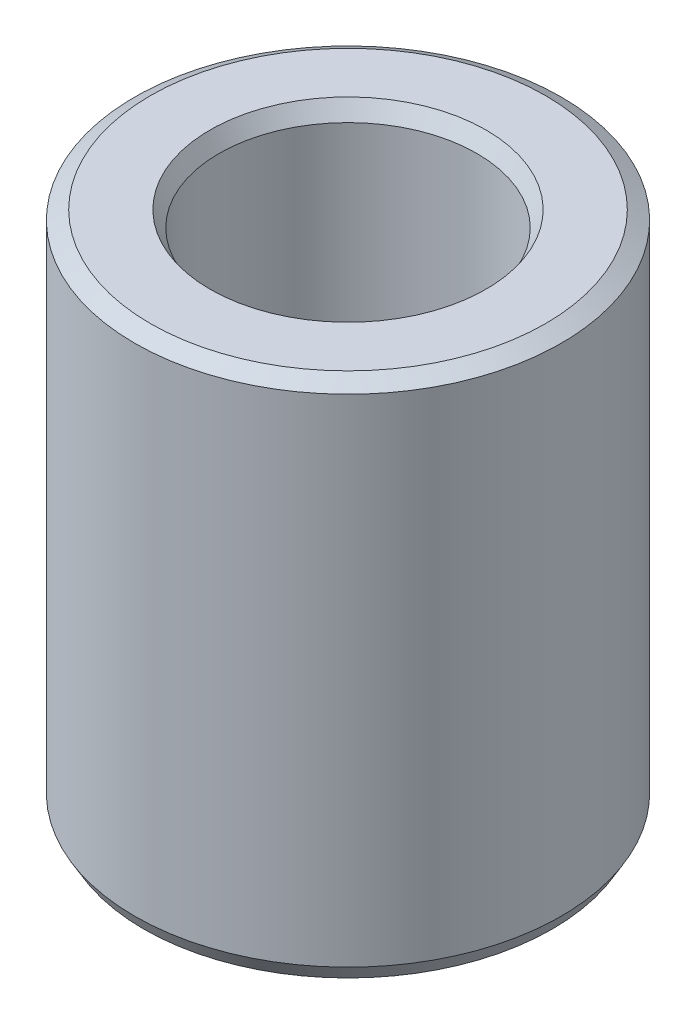
ISO-10303-21;
HEADER;
FILE_DESCRIPTION(('STEP AP214'),'2;1');
FILE_NAME('part.step','',(''),(''),'','','');
FILE_SCHEMA(('AUTOMOTIVE_DESIGN { 1 0 10303 214 1 1 1 1 }'));
ENDSEC;
DATA;
#1=APPLICATION_CONTEXT('core data for automotive mechanical design processes');
#2=APPLICATION_PROTOCOL_DEFINITION('international standard','automotive_design',2000,#1);
#3=PRODUCT_CONTEXT('',#1,'mechanical');
#4=PRODUCT('Part','Part','',(#3));
#5=PRODUCT_RELATED_PRODUCT_CATEGORY('part','',(#4));
#6=PRODUCT_DEFINITION_FORMATION('','',#4);
#7=PRODUCT_DEFINITION_CONTEXT('part definition',#1,'design');
#8=PRODUCT_DEFINITION('design','',#6,#7);
#9=PRODUCT_DEFINITION_SHAPE('','',#8);
#10=(LENGTH_UNIT() NAMED_UNIT(*) SI_UNIT(.MILLI.,.METRE.));
#11=(NAMED_UNIT(*) PLANE_ANGLE_UNIT() SI_UNIT($,.RADIAN.));
#12=(NAMED_UNIT(*) SI_UNIT($,.STERADIAN.) SOLID_ANGLE_UNIT());
#13=UNCERTAINTY_MEASURE_WITH_UNIT(LENGTH_MEASURE(1.E-05),#10,'distance_accuracy_value','');
#14=(GEOMETRIC_REPRESENTATION_CONTEXT(3) GLOBAL_UNCERTAINTY_ASSIGNED_CONTEXT((#13)) GLOBAL_UNIT_ASSIGNED_CONTEXT((#10,
#11,#12)) REPRESENTATION_CONTEXT('',''));
#15=CARTESIAN_POINT('',(0.,0.,0.));
#16=DIRECTION('',(0.,0.,1.));
#17=DIRECTION('',(1.,0.,0.));
#18=AXIS2_PLACEMENT_3D('',#15,#16,#17);
#19=CARTESIAN_POINT('',(0.,116.042489561249,0.));
#20=DIRECTION('',(0.,-1.,0.));
#21=DIRECTION('',(0.,0.,-1.));
#22=AXIS2_PLACEMENT_3D('',#19,#20,#21);
#23=CYLINDRICAL_SURFACE('',#22,47.5);
#24=CARTESIAN_POINT('',(0.,3.51237934349137,0.));
#25=DIRECTION('',(0.,1.,0.));
#26=DIRECTION('',(0.,0.,1.));
#27=AXIS2_PLACEMENT_3D('',#24,#25,#26);
#28=CIRCLE('',#27,47.5);
#29=CARTESIAN_POINT('',(0.,3.51237934349137,-47.5));
#30=VERTEX_POINT('',#29);
#31=EDGE_CURVE('E10',#30,#30,#28,.T.);
#32=CARTESIAN_POINT('',(0.,114.014616401789,0.));
#33=DIRECTION('',(0.,1.,0.));
#34=DIRECTION('',(0.,0.,1.));
#35=AXIS2_PLACEMENT_3D('',#32,#33,#34);
#36=CIRCLE('',#35,47.5);
#37=CARTESIAN_POINT('',(0.,114.014616401789,-47.5));
#38=VERTEX_POINT('',#37);
#39=EDGE_CURVE('E50',#38,#38,#36,.F.);
#40=CARTESIAN_POINT('',(0.,3.51237934349137,-47.5));
#41=CARTESIAN_POINT('',(0.,4.66344431284864,-47.5));
#42=CARTESIAN_POINT('',(0.,5.8145092822059,-47.5));
#43=CARTESIAN_POINT('',(0.,8.11663922092043,-47.5));
#44=CARTESIAN_POINT('',(0.,9.2677041902777,-47.5));
#45=CARTESIAN_POINT('',(0.,11.5698341289922,-47.5));
#46=CARTESIAN_POINT('',(0.,12.7208990983495,-47.5));
#47=CARTESIAN_POINT('',(0.,15.023029037064,-47.5));
#48=CARTESIAN_POINT('',(0.,16.1740940064213,-47.5));
#49=CARTESIAN_POINT('',(0.,18.4762239451358,-47.5));
#50=CARTESIAN_POINT('',(0.,19.6272889144931,-47.5));
#51=CARTESIAN_POINT('',(0.,21.9294188532076,-47.5));
#52=CARTESIAN_POINT('',(0.,23.0804838225649,-47.5));
#53=CARTESIAN_POINT('',(0.,25.3826137612794,-47.5));
#54=CARTESIAN_POINT('',(0.,26.5336787306367,-47.5));
#55=CARTESIAN_POINT('',(0.,28.8358086693512,-47.5));
#56=CARTESIAN_POINT('',(0.,29.9868736387085,-47.5));
#57=CARTESIAN_POINT('',(0.,32.289003577423,-47.5));
#58=CARTESIAN_POINT('',(0.,33.4400685467803,-47.5));
#59=CARTESIAN_POINT('',(0.,35.7421984854948,-47.5));
#60=CARTESIAN_POINT('',(0.,36.8932634548521,-47.5));
#61=CARTESIAN_POINT('',(0.,39.1953933935666,-47.5));
#62=CARTESIAN_POINT('',(0.,40.3464583629239,-47.5));
#63=CARTESIAN_POINT('',(0.,42.6485883016384,-47.5));
#64=CARTESIAN_POINT('',(0.,43.7996532709956,-47.5));
#65=CARTESIAN_POINT('',(0.,46.1017832097102,-47.5));
#66=CARTESIAN_POINT('',(0.,47.2528481790674,-47.5));
#67=CARTESIAN_POINT('',(0.,49.554978117782,-47.5));
#68=CARTESIAN_POINT('',(0.,50.7060430871392,-47.5));
#69=CARTESIAN_POINT('',(0.,53.0081730258538,-47.5));
#70=CARTESIAN_POINT('',(0.,54.159237995211,-47.5));
#71=CARTESIAN_POINT('',(0.,56.4613679339256,-47.5));
#72=CARTESIAN_POINT('',(0.,57.6124329032828,-47.5));
#73=CARTESIAN_POINT('',(0.,59.9145628419974,-47.5));
#74=CARTESIAN_POINT('',(0.,61.0656278113546,-47.5));
#75=CARTESIAN_POINT('',(0.,63.3677577500691,-47.5));
#76=CARTESIAN_POINT('',(0.,64.5188227194264,-47.5));
#77=CARTESIAN_POINT('',(0.,66.8209526581409,-47.5));
#78=CARTESIAN_POINT('',(0.,67.9720176274982,-47.5));
#79=CARTESIAN_POINT('',(0.,70.2741475662127,-47.5));
#80=CARTESIAN_POINT('',(0.,71.42521253557,-47.5));
#81=CARTESIAN_POINT('',(0.,73.7273424742845,-47.5));
#82=CARTESIAN_POINT('',(0.,74.8784074436418,-47.5));
#83=CARTESIAN_POINT('',(0.,77.1805373823563,-47.5));
#84=CARTESIAN_POINT('',(0.,78.3316023517136,-47.5));
#85=CARTESIAN_POINT('',(0.,80.6337322904281,-47.5));
#86=CARTESIAN_POINT('',(0.,81.7847972597854,-47.5));
#87=CARTESIAN_POINT('',(0.,84.0869271984999,-47.5));
#88=CARTESIAN_POINT('',(0.,85.2379921678572,-47.5));
#89=CARTESIAN_POINT('',(0.,87.5401221065717,-47.5));
#90=CARTESIAN_POINT('',(0.,88.691187075929,-47.5));
#91=CARTESIAN_POINT('',(0.,90.9933170146435,-47.5));
#92=CARTESIAN_POINT('',(0.,92.1443819840008,-47.5));
#93=CARTESIAN_POINT('',(0.,94.4465119227153,-47.5));
#94=CARTESIAN_POINT('',(0.,95.5975768920726,-47.5));
#95=CARTESIAN_POINT('',(0.,97.8997068307871,-47.5));
#96=CARTESIAN_POINT('',(0.,99.0507718001443,-47.5));
#97=CARTESIAN_POINT('',(0.,101.352901738859,-47.5));
#98=CARTESIAN_POINT('',(0.,102.503966708216,-47.5));
#99=CARTESIAN_POINT('',(0.,104.806096646931,-47.5));
#100=CARTESIAN_POINT('',(0.,105.957161616288,-47.5));
#101=CARTESIAN_POINT('',(0.,108.259291555002,-47.5));
#102=CARTESIAN_POINT('',(0.,109.41035652436,-47.5));
#103=CARTESIAN_POINT('',(0.,111.712486463074,-47.5));
#104=CARTESIAN_POINT('',(0.,112.863551432432,-47.5));
#105=CARTESIAN_POINT('',(0.,114.014616401789,-47.5));
#106=B_SPLINE_CURVE_WITH_KNOTS('',3,(#40,#41,#42,#43,#44,#45,#46,#47,#48,#49,#50,#51,#52,#53,
#54,#55,#56,#57,#58,#59,#60,#61,#62,#63,#64,#65,#66,#67,#68,#69,#70,#71,#72,#73,#74,#75,#76,#77,
#78,#79,#80,#81,#82,#83,#84,#85,#86,#87,#88,#89,#90,#91,#92,#93,#94,#95,#96,#97,#98,#99,#100,
#101,#102,#103,#104,#105),.UNSPECIFIED.,.F.,.F.,(4,2,2,2,2,2,2,2,2,2,2,2,2,2,2,2,2,2,2,2,2,2,2,
2,2,2,2,2,2,2,2,2,4),(0.,3.45319490807179,6.9063898161436,10.3595847242154,13.8127796322872,
17.265974540359,20.7191694484308,24.1723643565026,27.6255592645744,31.0787541726462,
34.531949080718,37.9851439887897,41.4383388968616,44.8915338049333,48.3447287130051,
51.7979236210769,55.2511185291487,58.7043134372205,62.1575083452923,65.6107032533641,
69.0638981614359,72.5170930695077,75.9702879775795,79.4234828856513,82.8766777937231,
86.3298727017949,89.7830676098666,93.2362625179385,96.6894574260103,100.142652334082,
103.595847242154,107.049042150226,110.502237058297),.UNSPECIFIED.);
#107=EDGE_CURVE('BSEAM39',#30,#38,#106,.T.);
#108=ORIENTED_EDGE('',*,*,#31,.T.);
#109=ORIENTED_EDGE('',*,*,#39,.T.);
#110=ORIENTED_EDGE('',*,*,#107,.T.);
#111=ORIENTED_EDGE('',*,*,#107,.F.);
#112=EDGE_LOOP('',(#108,#110,#109,#111));
#113=FACE_BOUND('',#112,.T.);
#114=ADVANCED_FACE('F39',(#113),#23,.T.);
#115=CARTESIAN_POINT('',(0.,116.042489561249,0.));
#116=DIRECTION('',(0.,1.,0.));
#117=DIRECTION('',(0.,0.,1.));
#118=AXIS2_PLACEMENT_3D('',#115,#116,#117);
#119=PLANE('',#118);
#120=CARTESIAN_POINT('',(0.,116.042489561249,0.));
#121=DIRECTION('',(0.,1.,0.));
#122=DIRECTION('',(0.,0.,1.));
#123=AXIS2_PLACEMENT_3D('',#120,#121,#122);
#124=CIRCLE('',#123,30.7315203117057);
#125=CARTESIAN_POINT('',(0.,116.042489561249,30.7315203117057));
#126=VERTEX_POINT('',#125);
#127=EDGE_CURVE('E58',#126,#126,#124,.F.);
#128=ORIENTED_EDGE('',*,*,#127,.T.);
#129=EDGE_LOOP('',(#128));
#130=FACE_BOUND('',#129,.T.);
#131=CARTESIAN_POINT('',(0.,116.042489561249,0.));
#132=DIRECTION('',(0.,1.,0.));
#133=DIRECTION('',(0.,0.,1.));
#134=AXIS2_PLACEMENT_3D('',#131,#132,#133);
#135=CIRCLE('',#134,43.987620656509);
#136=CARTESIAN_POINT('',(0.,116.042489561249,43.987620656509));
#137=VERTEX_POINT('',#136);
#138=EDGE_CURVE('E61',#137,#137,#135,.T.);
#139=ORIENTED_EDGE('',*,*,#138,.T.);
#140=EDGE_LOOP('',(#139));
#141=FACE_BOUND('',#140,.T.);
#142=ADVANCED_FACE('F88',(#130,#141),#119,.T.);
#143=CARTESIAN_POINT('',(0.,0.,0.));
#144=DIRECTION('',(0.,1.,0.));
#145=DIRECTION('',(0.,0.,1.));
#146=AXIS2_PLACEMENT_3D('',#143,#144,#145);
#147=PLANE('',#146);
#148=CARTESIAN_POINT('',(0.,0.,0.));
#149=DIRECTION('',(0.,1.,0.));
#150=DIRECTION('',(0.,0.,1.));
#151=AXIS2_PLACEMENT_3D('',#148,#149,#150);
#152=CIRCLE('',#151,32.2160264957358);
#153=CARTESIAN_POINT('',(0.,0.,32.2160264957358));
#154=VERTEX_POINT('',#153);
#155=EDGE_CURVE('E51',#154,#154,#152,.T.);
#156=ORIENTED_EDGE('',*,*,#155,.T.);
#157=EDGE_LOOP('',(#156));
#158=FACE_BOUND('',#157,.T.);
#159=CARTESIAN_POINT('',(0.,0.,0.));
#160=DIRECTION('',(0.,1.,0.));
#161=DIRECTION('',(0.,0.,1.));
#162=AXIS2_PLACEMENT_3D('',#159,#160,#161);
#163=CIRCLE('',#162,45.4721268405392);
#164=CARTESIAN_POINT('',(0.,0.,45.4721268405392));
#165=VERTEX_POINT('',#164);
#166=EDGE_CURVE('E54',#165,#165,#163,.F.);
#167=ORIENTED_EDGE('',*,*,#166,.T.);
#168=EDGE_LOOP('',(#167));
#169=FACE_BOUND('',#168,.T.);
#170=ADVANCED_FACE('F83',(#158,#169),#147,.F.);
#171=CARTESIAN_POINT('',(0.,116.042489561249,0.));
#172=DIRECTION('',(0.,-1.,0.));
#173=DIRECTION('',(0.,0.,-1.));
#174=AXIS2_PLACEMENT_3D('',#171,#172,#173);
#175=CYLINDRICAL_SURFACE('',#174,28.7036471522449);
#176=CARTESIAN_POINT('',(0.,112.530110217758,0.));
#177=DIRECTION('',(0.,1.,0.));
#178=DIRECTION('',(0.,0.,1.));
#179=AXIS2_PLACEMENT_3D('',#176,#177,#178);
#180=CIRCLE('',#179,28.7036471522449);
#181=CARTESIAN_POINT('',(0.,112.530110217758,-28.7036471522449));
#182=VERTEX_POINT('',#181);
#183=EDGE_CURVE('E67',#182,#182,#180,.T.);
#184=CARTESIAN_POINT('',(0.,2.02787315946064,0.));
#185=DIRECTION('',(0.,1.,0.));
#186=DIRECTION('',(0.,0.,1.));
#187=AXIS2_PLACEMENT_3D('',#184,#185,#186);
#188=CIRCLE('',#187,28.7036471522449);
#189=CARTESIAN_POINT('',(0.,2.02787315946064,-28.7036471522449));
#190=VERTEX_POINT('',#189);
#191=EDGE_CURVE('E69',#190,#190,#188,.F.);
#192=CARTESIAN_POINT('',(0.,112.530110217758,-28.7036471522449));
#193=CARTESIAN_POINT('',(0.,111.379045248401,-28.7036471522449));
#194=CARTESIAN_POINT('',(0.,110.227980279044,-28.7036471522449));
#195=CARTESIAN_POINT('',(0.,107.925850340329,-28.7036471522449));
#196=CARTESIAN_POINT('',(0.,106.774785370972,-28.7036471522449));
#197=CARTESIAN_POINT('',(0.,104.472655432257,-28.7036471522449));
#198=CARTESIAN_POINT('',(0.,103.3215904629,-28.7036471522449));
#199=CARTESIAN_POINT('',(0.,101.019460524185,-28.7036471522449));
#200=CARTESIAN_POINT('',(0.,99.8683955548282,-28.7036471522449));
#201=CARTESIAN_POINT('',(0.,97.5662656161137,-28.7036471522449));
#202=CARTESIAN_POINT('',(0.,96.4152006467564,-28.7036471522449));
#203=CARTESIAN_POINT('',(0.,94.1130707080419,-28.7036471522449));
#204=CARTESIAN_POINT('',(0.,92.9620057386846,-28.7036471522449));
#205=CARTESIAN_POINT('',(0.,90.6598757999701,-28.7036471522449));
#206=CARTESIAN_POINT('',(0.,89.5088108306128,-28.7036471522449));
#207=CARTESIAN_POINT('',(0.,87.2066808918983,-28.7036471522449));
#208=CARTESIAN_POINT('',(0.,86.055615922541,-28.7036471522449));
#209=CARTESIAN_POINT('',(0.,83.7534859838265,-28.7036471522449));
#210=CARTESIAN_POINT('',(0.,82.6024210144692,-28.7036471522449));
#211=CARTESIAN_POINT('',(0.,80.3002910757547,-28.7036471522449));
#212=CARTESIAN_POINT('',(0.,79.1492261063974,-28.7036471522449));
#213=CARTESIAN_POINT('',(0.,76.8470961676829,-28.7036471522449));
#214=CARTESIAN_POINT('',(0.,75.6960311983256,-28.7036471522449));
#215=CARTESIAN_POINT('',(0.,73.3939012596111,-28.7036471522449));
#216=CARTESIAN_POINT('',(0.,72.2428362902538,-28.7036471522449));
#217=CARTESIAN_POINT('',(0.,69.9407063515393,-28.7036471522449));
#218=CARTESIAN_POINT('',(0.,68.7896413821821,-28.7036471522449));
#219=CARTESIAN_POINT('',(0.,66.4875114434675,-28.7036471522449));
#220=CARTESIAN_POINT('',(0.,65.3364464741102,-28.7036471522449));
#221=CARTESIAN_POINT('',(0.,63.0343165353957,-28.7036471522449));
#222=CARTESIAN_POINT('',(0.,61.8832515660384,-28.7036471522449));
#223=CARTESIAN_POINT('',(0.,59.5811216273239,-28.7036471522449));
#224=CARTESIAN_POINT('',(0.,58.4300566579667,-28.7036471522449));
#225=CARTESIAN_POINT('',(0.,56.1279267192521,-28.7036471522449));
#226=CARTESIAN_POINT('',(0.,54.9768617498949,-28.7036471522449));
#227=CARTESIAN_POINT('',(0.,52.6747318111803,-28.7036471522449));
#228=CARTESIAN_POINT('',(0.,51.5236668418231,-28.7036471522449));
#229=CARTESIAN_POINT('',(0.,49.2215369031085,-28.7036471522449));
#230=CARTESIAN_POINT('',(0.,48.0704719337513,-28.7036471522449));
#231=CARTESIAN_POINT('',(0.,45.7683419950367,-28.7036471522449));
#232=CARTESIAN_POINT('',(0.,44.6172770256795,-28.7036471522449));
#233=CARTESIAN_POINT('',(0.,42.3151470869649,-28.7036471522449));
#234=CARTESIAN_POINT('',(0.,41.1640821176077,-28.7036471522449));
#235=CARTESIAN_POINT('',(0.,38.8619521788931,-28.7036471522449));
#236=CARTESIAN_POINT('',(0.,37.7108872095359,-28.7036471522449));
#237=CARTESIAN_POINT('',(0.,35.4087572708213,-28.7036471522449));
#238=CARTESIAN_POINT('',(0.,34.2576923014641,-28.7036471522449));
#239=CARTESIAN_POINT('',(0.,31.9555623627495,-28.7036471522449));
#240=CARTESIAN_POINT('',(0.,30.8044973933923,-28.7036471522449));
#241=CARTESIAN_POINT('',(0.,28.5023674546777,-28.7036471522449));
#242=CARTESIAN_POINT('',(0.,27.3513024853205,-28.7036471522449));
#243=CARTESIAN_POINT('',(0.,25.0491725466059,-28.7036471522449));
#244=CARTESIAN_POINT('',(0.,23.8981075772487,-28.7036471522449));
#245=CARTESIAN_POINT('',(0.,21.5959776385341,-28.7036471522449));
#246=CARTESIAN_POINT('',(0.,20.4449126691769,-28.7036471522449));
#247=CARTESIAN_POINT('',(0.,18.1427827304624,-28.7036471522449));
#248=CARTESIAN_POINT('',(0.,16.9917177611051,-28.7036471522449));
#249=CARTESIAN_POINT('',(0.,14.6895878223906,-28.7036471522449));
#250=CARTESIAN_POINT('',(0.,13.5385228530333,-28.7036471522449));
#251=CARTESIAN_POINT('',(0.,11.2363929143188,-28.7036471522449));
#252=CARTESIAN_POINT('',(0.,10.0853279449615,-28.7036471522449));
#253=CARTESIAN_POINT('',(0.,7.78319800624697,-28.7036471522449));
#254=CARTESIAN_POINT('',(0.,6.6321330368897,-28.7036471522449));
#255=CARTESIAN_POINT('',(0.,4.33000309817517,-28.7036471522449));
#256=CARTESIAN_POINT('',(0.,3.1789381288179,-28.7036471522449));
#257=CARTESIAN_POINT('',(0.,2.02787315946064,-28.7036471522449));
#258=B_SPLINE_CURVE_WITH_KNOTS('',3,(#192,#193,#194,#195,#196,#197,#198,#199,#200,#201,#202,
#203,#204,#205,#206,#207,#208,#209,#210,#211,#212,#213,#214,#215,#216,#217,#218,#219,#220,#221,
#222,#223,#224,#225,#226,#227,#228,#229,#230,#231,#232,#233,#234,#235,#236,#237,#238,#239,#240,
#241,#242,#243,#244,#245,#246,#247,#248,#249,#250,#251,#252,#253,#254,#255,#256,#257),
.UNSPECIFIED.,.F.,.F.,(4,2,2,2,2,2,2,2,2,2,2,2,2,2,2,2,2,2,2,2,2,2,2,2,2,2,2,2,2,2,2,2,4),(0.,
3.45319490807179,6.90638981614358,10.3595847242154,13.8127796322872,17.265974540359,
20.7191694484308,24.1723643565026,27.6255592645744,31.0787541726462,34.531949080718,
37.9851439887898,41.4383388968616,44.8915338049333,48.3447287130051,51.7979236210769,
55.2511185291487,58.7043134372205,62.1575083452923,65.6107032533641,69.0638981614359,
72.5170930695077,75.9702879775795,79.4234828856513,82.8766777937231,86.3298727017949,
89.7830676098667,93.2362625179385,96.6894574260103,100.142652334082,103.595847242154,
107.049042150226,110.502237058297),.UNSPECIFIED.);
#259=EDGE_CURVE('BSEAM71',#182,#190,#258,.T.);
#260=ORIENTED_EDGE('',*,*,#183,.T.);
#261=ORIENTED_EDGE('',*,*,#191,.T.);
#262=ORIENTED_EDGE('',*,*,#259,.T.);
#263=ORIENTED_EDGE('',*,*,#259,.F.);
#264=EDGE_LOOP('',(#260,#262,#261,#263));
#265=FACE_BOUND('',#264,.T.);
#266=ADVANCED_FACE('F71',(#265),#175,.F.);
#267=CARTESIAN_POINT('',(0.,112.530110217758,0.));
#268=DIRECTION('',(0.,1.,0.));
#269=DIRECTION('',(0.,0.,1.));
#270=AXIS2_PLACEMENT_3D('',#267,#268,#269);
#271=CONICAL_SURFACE('',#270,28.7036471522449,0.523598775598307);
#272=ORIENTED_EDGE('',*,*,#127,.F.);
#273=EDGE_LOOP('',(#272));
#274=FACE_BOUND('',#273,.T.);
#275=ORIENTED_EDGE('',*,*,#183,.F.);
#276=EDGE_LOOP('',(#275));
#277=FACE_BOUND('',#276,.T.);
#278=ADVANCED_FACE('F77',(#274,#277),#271,.F.);
#279=CARTESIAN_POINT('',(0.,0.,0.));
#280=DIRECTION('',(0.,-1.,0.));
#281=DIRECTION('',(0.,0.,-1.));
#282=AXIS2_PLACEMENT_3D('',#279,#280,#281);
#283=CONICAL_SURFACE('',#282,32.2160264957358,1.04719755119659);
#284=ORIENTED_EDGE('',*,*,#191,.F.);
#285=EDGE_LOOP('',(#284));
#286=FACE_BOUND('',#285,.T.);
#287=ORIENTED_EDGE('',*,*,#155,.F.);
#288=EDGE_LOOP('',(#287));
#289=FACE_BOUND('',#288,.T.);
#290=ADVANCED_FACE('F73',(#286,#289),#283,.F.);
#291=CARTESIAN_POINT('',(0.,3.51237934349137,0.));
#292=DIRECTION('',(0.,1.,0.));
#293=DIRECTION('',(0.,0.,1.));
#294=AXIS2_PLACEMENT_3D('',#291,#292,#293);
#295=CONICAL_SURFACE('',#294,47.5,0.523598775598305);
#296=ORIENTED_EDGE('',*,*,#166,.F.);
#297=EDGE_LOOP('',(#296));
#298=FACE_BOUND('',#297,.T.);
#299=ORIENTED_EDGE('',*,*,#31,.F.);
#300=EDGE_LOOP('',(#299));
#301=FACE_BOUND('',#300,.T.);
#302=ADVANCED_FACE('F76',(#298,#301),#295,.T.);
#303=CARTESIAN_POINT('',(0.,116.042489561249,0.));
#304=DIRECTION('',(0.,-1.,0.));
#305=DIRECTION('',(0.,0.,-1.));
#306=AXIS2_PLACEMENT_3D('',#303,#304,#305);
#307=CONICAL_SURFACE('',#306,43.987620656509,1.04719755119659);
#308=ORIENTED_EDGE('',*,*,#39,.F.);
#309=EDGE_LOOP('',(#308));
#310=FACE_BOUND('',#309,.T.);
#311=ORIENTED_EDGE('',*,*,#138,.F.);
#312=EDGE_LOOP('',(#311));
#313=FACE_BOUND('',#312,.T.);
#314=ADVANCED_FACE('F45',(#310,#313),#307,.T.);
#315=CLOSED_SHELL('',(#114,#142,#170,#266,#278,#290,#302,#314));
#316=MANIFOLD_SOLID_BREP('B2',#315);
#317=ADVANCED_BREP_SHAPE_REPRESENTATION('',(#18,#316),#14);
#318=SHAPE_DEFINITION_REPRESENTATION(#9,#317);
ENDSEC;
END-ISO-10303-21;
